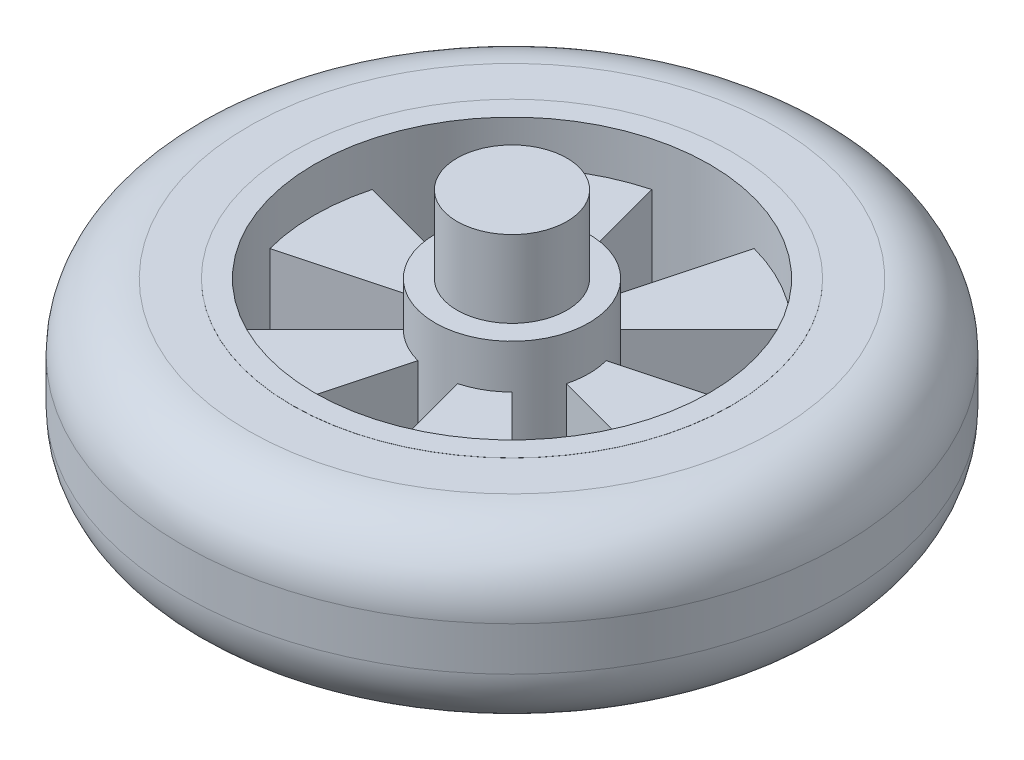
ISO-10303-21;
HEADER;
FILE_DESCRIPTION(('STEP AP214'),'2;1');
FILE_NAME('part.step','',(''),(''),'','','');
FILE_SCHEMA(('AUTOMOTIVE_DESIGN { 1 0 10303 214 1 1 1 1 }'));
ENDSEC;
DATA;
#1=APPLICATION_CONTEXT('core data for automotive mechanical design processes');
#2=APPLICATION_PROTOCOL_DEFINITION('international standard','automotive_design',2000,#1);
#3=PRODUCT_CONTEXT('',#1,'mechanical');
#4=PRODUCT('Part','Part','',(#3));
#5=PRODUCT_RELATED_PRODUCT_CATEGORY('part','',(#4));
#6=PRODUCT_DEFINITION_FORMATION('','',#4);
#7=PRODUCT_DEFINITION_CONTEXT('part definition',#1,'design');
#8=PRODUCT_DEFINITION('design','',#6,#7);
#9=PRODUCT_DEFINITION_SHAPE('','',#8);
#10=(LENGTH_UNIT() NAMED_UNIT(*) SI_UNIT(.MILLI.,.METRE.));
#11=(NAMED_UNIT(*) PLANE_ANGLE_UNIT() SI_UNIT($,.RADIAN.));
#12=(NAMED_UNIT(*) SI_UNIT($,.STERADIAN.) SOLID_ANGLE_UNIT());
#13=UNCERTAINTY_MEASURE_WITH_UNIT(LENGTH_MEASURE(1.E-05),#10,'distance_accuracy_value','');
#14=(GEOMETRIC_REPRESENTATION_CONTEXT(3) GLOBAL_UNCERTAINTY_ASSIGNED_CONTEXT((#13)) GLOBAL_UNIT_ASSIGNED_CONTEXT((#10,
#11,#12)) REPRESENTATION_CONTEXT('',''));
#15=CARTESIAN_POINT('',(0.,0.,0.));
#16=DIRECTION('',(0.,0.,1.));
#17=DIRECTION('',(1.,0.,0.));
#18=AXIS2_PLACEMENT_3D('',#15,#16,#17);
#19=CARTESIAN_POINT('',(0.,-8.,0.));
#20=DIRECTION('',(0.,1.,0.));
#21=DIRECTION('',(0.,0.,1.));
#22=AXIS2_PLACEMENT_3D('',#19,#20,#21);
#23=CYLINDRICAL_SURFACE('',#22,20.);
#24=CARTESIAN_POINT('',(0.,-8.,0.));
#25=DIRECTION('',(0.,1.,0.));
#26=DIRECTION('',(0.,0.,1.));
#27=AXIS2_PLACEMENT_3D('',#24,#25,#26);
#28=CIRCLE('',#27,20.);
#29=CARTESIAN_POINT('',(0.,-8.,20.));
#30=VERTEX_POINT('',#29);
#31=EDGE_CURVE('E238',#30,#30,#28,.T.);
#32=ORIENTED_EDGE('',*,*,#31,.T.);
#33=EDGE_LOOP('',(#32));
#34=FACE_BOUND('',#33,.T.);
#35=CARTESIAN_POINT('',(0.,-7.99,0.));
#36=DIRECTION('',(0.,1.,0.));
#37=DIRECTION('',(0.,0.,1.));
#38=AXIS2_PLACEMENT_3D('',#35,#36,#37);
#39=CIRCLE('',#38,20.);
#40=CARTESIAN_POINT('',(0.,-7.99,20.));
#41=VERTEX_POINT('',#40);
#42=EDGE_CURVE('E449',#41,#41,#39,.T.);
#43=ORIENTED_EDGE('',*,*,#42,.F.);
#44=EDGE_LOOP('',(#43));
#45=FACE_BOUND('',#44,.T.);
#46=ADVANCED_FACE('F35',(#34,#45),#23,.T.);
#47=CARTESIAN_POINT('',(0.,4.,0.));
#48=DIRECTION('',(0.,1.,0.));
#49=DIRECTION('',(0.,0.,1.));
#50=AXIS2_PLACEMENT_3D('',#47,#48,#49);
#51=PLANE('',#50);
#52=DIRECTION('',(-0.707106781186544,0.,-0.707106781186551));
#53=VECTOR('',#52,1.);
#54=CARTESIAN_POINT('',(-4.94974746830581,4.,-4.94974746830586));
#55=LINE('',#54,#53);
#56=CARTESIAN_POINT('',(-4.94974746830581,4.,-4.94974746830586));
#57=VERTEX_POINT('',#56);
#58=CARTESIAN_POINT('',(-12.7279220613578,4.,-12.7279220613579));
#59=VERTEX_POINT('',#58);
#60=EDGE_CURVE('E452',#57,#59,#55,.T.);
#61=ORIENTED_EDGE('',*,*,#60,.F.);
#62=CARTESIAN_POINT('',(0.,4.,0.));
#63=DIRECTION('',(0.,1.,0.));
#64=DIRECTION('',(0.,0.,1.));
#65=AXIS2_PLACEMENT_3D('',#62,#63,#64);
#66=CIRCLE('',#65,7.);
#67=CARTESIAN_POINT('',(-1.8117333157176,4.,-6.76148078402349));
#68=VERTEX_POINT('',#67);
#69=EDGE_CURVE('E235',#68,#57,#66,.T.);
#70=ORIENTED_EDGE('',*,*,#69,.F.);
#71=DIRECTION('',(0.258819045102515,0.,0.96592582628907));
#72=VECTOR('',#71,1.);
#73=CARTESIAN_POINT('',(-1.8117333157176,4.,-6.76148078402349));
#74=LINE('',#73,#72);
#75=CARTESIAN_POINT('',(-4.65874281184526,4.,-17.3866648732033));
#76=VERTEX_POINT('',#75);
#77=EDGE_CURVE('E529',#76,#68,#74,.T.);
#78=ORIENTED_EDGE('',*,*,#77,.F.);
#79=CARTESIAN_POINT('',(0.,4.,0.));
#80=DIRECTION('',(0.,1.,0.));
#81=DIRECTION('',(0.,0.,1.));
#82=AXIS2_PLACEMENT_3D('',#79,#80,#81);
#83=CIRCLE('',#82,18.);
#84=EDGE_CURVE('E225',#76,#59,#83,.T.);
#85=ORIENTED_EDGE('',*,*,#84,.T.);
#86=EDGE_LOOP('',(#61,#70,#78,#85));
#87=FACE_BOUND('',#86,.T.);
#88=ADVANCED_FACE('F308',(#87),#51,.T.);
#89=DIRECTION('',(0.965925826289064,0.,0.258819045102538));
#90=VECTOR('',#89,1.);
#91=CARTESIAN_POINT('',(-6.76148078402344,4.,-1.81173331571777));
#92=LINE('',#91,#90);
#93=CARTESIAN_POINT('',(-17.3866648732031,4.,-4.65874281184569));
#94=VERTEX_POINT('',#93);
#95=CARTESIAN_POINT('',(-6.76148078402344,4.,-1.81173331571777));
#96=VERTEX_POINT('',#95);
#97=EDGE_CURVE('E450',#94,#96,#92,.T.);
#98=ORIENTED_EDGE('',*,*,#97,.F.);
#99=CARTESIAN_POINT('',(-17.3866648732032,4.,4.65874281184533));
#100=VERTEX_POINT('',#99);
#101=EDGE_CURVE('E230',#94,#100,#83,.T.);
#102=ORIENTED_EDGE('',*,*,#101,.T.);
#103=DIRECTION('',(-0.965925826289069,0.,0.258819045102518));
#104=VECTOR('',#103,1.);
#105=CARTESIAN_POINT('',(-6.76148078402348,4.,1.81173331571763));
#106=LINE('',#105,#104);
#107=CARTESIAN_POINT('',(-6.76148078402348,4.,1.81173331571763));
#108=VERTEX_POINT('',#107);
#109=EDGE_CURVE('E478',#108,#100,#106,.T.);
#110=ORIENTED_EDGE('',*,*,#109,.F.);
#111=EDGE_CURVE('E367',#96,#108,#66,.T.);
#112=ORIENTED_EDGE('',*,*,#111,.F.);
#113=EDGE_LOOP('',(#98,#102,#110,#112));
#114=FACE_BOUND('',#113,.T.);
#115=ADVANCED_FACE('F313',(#114),#51,.T.);
#116=DIRECTION('',(0.707106781186559,0.,-0.707106781186537));
#117=VECTOR('',#116,1.);
#118=CARTESIAN_POINT('',(-4.94974746830591,4.,4.94974746830576));
#119=LINE('',#118,#117);
#120=CARTESIAN_POINT('',(-12.7279220613581,4.,12.7279220613577));
#121=VERTEX_POINT('',#120);
#122=CARTESIAN_POINT('',(-4.94974746830591,4.,4.94974746830576));
#123=VERTEX_POINT('',#122);
#124=EDGE_CURVE('E476',#121,#123,#119,.T.);
#125=ORIENTED_EDGE('',*,*,#124,.F.);
#126=CARTESIAN_POINT('',(-4.65874281184526,4.,17.3866648732033));
#127=VERTEX_POINT('',#126);
#128=EDGE_CURVE('E223',#121,#127,#83,.T.);
#129=ORIENTED_EDGE('',*,*,#128,.T.);
#130=DIRECTION('',(-0.258819045102514,0.,0.96592582628907));
#131=VECTOR('',#130,1.);
#132=CARTESIAN_POINT('',(-1.8117333157176,4.,6.76148078402349));
#133=LINE('',#132,#131);
#134=CARTESIAN_POINT('',(-1.8117333157176,4.,6.76148078402349));
#135=VERTEX_POINT('',#134);
#136=EDGE_CURVE('E464',#135,#127,#133,.T.);
#137=ORIENTED_EDGE('',*,*,#136,.F.);
#138=EDGE_CURVE('E373',#123,#135,#66,.T.);
#139=ORIENTED_EDGE('',*,*,#138,.F.);
#140=EDGE_LOOP('',(#125,#129,#137,#139));
#141=FACE_BOUND('',#140,.T.);
#142=ADVANCED_FACE('F617',(#141),#51,.T.);
#143=DIRECTION('',(-0.258819045102515,0.,-0.96592582628907));
#144=VECTOR('',#143,1.);
#145=CARTESIAN_POINT('',(1.8117333157176,4.,6.76148078402349));
#146=LINE('',#145,#144);
#147=CARTESIAN_POINT('',(4.65874281184526,4.,17.3866648732033));
#148=VERTEX_POINT('',#147);
#149=CARTESIAN_POINT('',(1.8117333157176,4.,6.76148078402349));
#150=VERTEX_POINT('',#149);
#151=EDGE_CURVE('E462',#148,#150,#146,.T.);
#152=ORIENTED_EDGE('',*,*,#151,.F.);
#153=CARTESIAN_POINT('',(12.7279220613579,4.,12.7279220613578));
#154=VERTEX_POINT('',#153);
#155=EDGE_CURVE('E219',#148,#154,#83,.T.);
#156=ORIENTED_EDGE('',*,*,#155,.T.);
#157=DIRECTION('',(0.707106781186549,0.,0.707106781186546));
#158=VECTOR('',#157,1.);
#159=CARTESIAN_POINT('',(4.94974746830584,4.,4.94974746830582));
#160=LINE('',#159,#158);
#161=CARTESIAN_POINT('',(4.94974746830584,4.,4.94974746830582));
#162=VERTEX_POINT('',#161);
#163=EDGE_CURVE('E203',#162,#154,#160,.T.);
#164=ORIENTED_EDGE('',*,*,#163,.F.);
#165=EDGE_CURVE('E378',#150,#162,#66,.T.);
#166=ORIENTED_EDGE('',*,*,#165,.F.);
#167=EDGE_LOOP('',(#152,#156,#164,#166));
#168=FACE_BOUND('',#167,.T.);
#169=ADVANCED_FACE('F628',(#168),#51,.T.);
#170=DIRECTION('',(-0.965925826289066,0.,-0.258819045102531));
#171=VECTOR('',#170,1.);
#172=CARTESIAN_POINT('',(6.76148078402346,4.,1.81173331571772));
#173=LINE('',#172,#171);
#174=CARTESIAN_POINT('',(17.3866648732032,4.,4.65874281184556));
#175=VERTEX_POINT('',#174);
#176=CARTESIAN_POINT('',(6.76148078402346,4.,1.81173331571772));
#177=VERTEX_POINT('',#176);
#178=EDGE_CURVE('E58',#175,#177,#173,.T.);
#179=ORIENTED_EDGE('',*,*,#178,.F.);
#180=CARTESIAN_POINT('',(17.3866648732032,4.,-4.65874281184545));
#181=VERTEX_POINT('',#180);
#182=EDGE_CURVE('E210',#175,#181,#83,.T.);
#183=ORIENTED_EDGE('',*,*,#182,.T.);
#184=DIRECTION('',(0.965925826289067,0.,-0.258819045102525));
#185=VECTOR('',#184,1.);
#186=CARTESIAN_POINT('',(6.76148078402347,4.,-1.81173331571768));
#187=LINE('',#186,#185);
#188=CARTESIAN_POINT('',(6.76148078402347,4.,-1.81173331571768));
#189=VERTEX_POINT('',#188);
#190=EDGE_CURVE('E501',#189,#181,#187,.T.);
#191=ORIENTED_EDGE('',*,*,#190,.F.);
#192=EDGE_CURVE('E212',#177,#189,#66,.T.);
#193=ORIENTED_EDGE('',*,*,#192,.F.);
#194=EDGE_LOOP('',(#179,#183,#191,#193));
#195=FACE_BOUND('',#194,.T.);
#196=ADVANCED_FACE('F208',(#195),#51,.T.);
#197=CARTESIAN_POINT('',(0.,-4.,0.));
#198=DIRECTION('',(0.,-1.,0.));
#199=DIRECTION('',(0.,0.,1.));
#200=AXIS2_PLACEMENT_3D('',#197,#198,#199);
#201=PLANE('',#200);
#202=DIRECTION('',(0.707106781186544,0.,0.707106781186551));
#203=VECTOR('',#202,1.);
#204=CARTESIAN_POINT('',(0.,-4.,0.));
#205=LINE('',#204,#203);
#206=CARTESIAN_POINT('',(-12.7279220613578,-4.,-12.7279220613579));
#207=VERTEX_POINT('',#206);
#208=CARTESIAN_POINT('',(-4.94974746830581,-4.,-4.94974746830586));
#209=VERTEX_POINT('',#208);
#210=EDGE_CURVE('E527',#207,#209,#205,.T.);
#211=ORIENTED_EDGE('',*,*,#210,.F.);
#212=CARTESIAN_POINT('',(0.,-4.,0.));
#213=DIRECTION('',(0.,1.,0.));
#214=DIRECTION('',(0.,0.,1.));
#215=AXIS2_PLACEMENT_3D('',#212,#213,#214);
#216=CIRCLE('',#215,18.);
#217=CARTESIAN_POINT('',(-4.65874281184526,-4.,-17.3866648732033));
#218=VERTEX_POINT('',#217);
#219=EDGE_CURVE('E359',#218,#207,#216,.T.);
#220=ORIENTED_EDGE('',*,*,#219,.F.);
#221=DIRECTION('',(-0.258819045102515,0.,-0.96592582628907));
#222=VECTOR('',#221,1.);
#223=CARTESIAN_POINT('',(0.,-4.,0.));
#224=LINE('',#223,#222);
#225=CARTESIAN_POINT('',(-1.8117333157176,-4.,-6.76148078402349));
#226=VERTEX_POINT('',#225);
#227=EDGE_CURVE('E356',#226,#218,#224,.T.);
#228=ORIENTED_EDGE('',*,*,#227,.F.);
#229=CARTESIAN_POINT('',(0.,-4.,0.));
#230=DIRECTION('',(0.,1.,0.));
#231=DIRECTION('',(0.,0.,1.));
#232=AXIS2_PLACEMENT_3D('',#229,#230,#231);
#233=CIRCLE('',#232,7.);
#234=EDGE_CURVE('E354',#226,#209,#233,.T.);
#235=ORIENTED_EDGE('',*,*,#234,.T.);
#236=EDGE_LOOP('',(#211,#220,#228,#235));
#237=FACE_BOUND('',#236,.T.);
#238=ADVANCED_FACE('F394',(#237),#201,.T.);
#239=DIRECTION('',(-0.965925826289064,0.,-0.258819045102538));
#240=VECTOR('',#239,1.);
#241=CARTESIAN_POINT('',(0.,-4.,0.));
#242=LINE('',#241,#240);
#243=CARTESIAN_POINT('',(-6.76148078402344,-4.,-1.81173331571777));
#244=VERTEX_POINT('',#243);
#245=CARTESIAN_POINT('',(-17.3866648732031,-4.,-4.65874281184569));
#246=VERTEX_POINT('',#245);
#247=EDGE_CURVE('E525',#244,#246,#242,.T.);
#248=ORIENTED_EDGE('',*,*,#247,.F.);
#249=CARTESIAN_POINT('',(-6.76148078402348,-4.,1.81173331571763));
#250=VERTEX_POINT('',#249);
#251=EDGE_CURVE('E555',#244,#250,#233,.T.);
#252=ORIENTED_EDGE('',*,*,#251,.T.);
#253=DIRECTION('',(0.965925826289069,0.,-0.258819045102518));
#254=VECTOR('',#253,1.);
#255=CARTESIAN_POINT('',(0.,-4.,0.));
#256=LINE('',#255,#254);
#257=CARTESIAN_POINT('',(-17.3866648732032,-4.,4.65874281184533));
#258=VERTEX_POINT('',#257);
#259=EDGE_CURVE('E523',#258,#250,#256,.T.);
#260=ORIENTED_EDGE('',*,*,#259,.F.);
#261=EDGE_CURVE('E362',#246,#258,#216,.T.);
#262=ORIENTED_EDGE('',*,*,#261,.F.);
#263=EDGE_LOOP('',(#248,#252,#260,#262));
#264=FACE_BOUND('',#263,.T.);
#265=ADVANCED_FACE('F604',(#264),#201,.T.);
#266=DIRECTION('',(-0.707106781186559,0.,0.707106781186537));
#267=VECTOR('',#266,1.);
#268=CARTESIAN_POINT('',(0.,-4.,0.));
#269=LINE('',#268,#267);
#270=CARTESIAN_POINT('',(-4.94974746830591,-4.,4.94974746830576));
#271=VERTEX_POINT('',#270);
#272=CARTESIAN_POINT('',(-12.7279220613581,-4.,12.7279220613577));
#273=VERTEX_POINT('',#272);
#274=EDGE_CURVE('E521',#271,#273,#269,.T.);
#275=ORIENTED_EDGE('',*,*,#274,.F.);
#276=CARTESIAN_POINT('',(-1.8117333157176,-4.,6.76148078402349));
#277=VERTEX_POINT('',#276);
#278=EDGE_CURVE('E557',#271,#277,#233,.T.);
#279=ORIENTED_EDGE('',*,*,#278,.T.);
#280=DIRECTION('',(0.258819045102514,0.,-0.96592582628907));
#281=VECTOR('',#280,1.);
#282=CARTESIAN_POINT('',(0.,-4.,0.));
#283=LINE('',#282,#281);
#284=CARTESIAN_POINT('',(-4.65874281184526,-4.,17.3866648732033));
#285=VERTEX_POINT('',#284);
#286=EDGE_CURVE('E519',#285,#277,#283,.T.);
#287=ORIENTED_EDGE('',*,*,#286,.F.);
#288=EDGE_CURVE('E582',#273,#285,#216,.T.);
#289=ORIENTED_EDGE('',*,*,#288,.F.);
#290=EDGE_LOOP('',(#275,#279,#287,#289));
#291=FACE_BOUND('',#290,.T.);
#292=ADVANCED_FACE('F632',(#291),#201,.T.);
#293=DIRECTION('',(0.258819045102515,0.,0.96592582628907));
#294=VECTOR('',#293,1.);
#295=CARTESIAN_POINT('',(0.,-4.,0.));
#296=LINE('',#295,#294);
#297=CARTESIAN_POINT('',(1.8117333157176,-4.,6.76148078402349));
#298=VERTEX_POINT('',#297);
#299=CARTESIAN_POINT('',(4.65874281184526,-4.,17.3866648732033));
#300=VERTEX_POINT('',#299);
#301=EDGE_CURVE('E517',#298,#300,#296,.T.);
#302=ORIENTED_EDGE('',*,*,#301,.F.);
#303=CARTESIAN_POINT('',(4.94974746830584,-4.,4.94974746830582));
#304=VERTEX_POINT('',#303);
#305=EDGE_CURVE('E563',#298,#304,#233,.T.);
#306=ORIENTED_EDGE('',*,*,#305,.T.);
#307=DIRECTION('',(-0.707106781186549,0.,-0.707106781186546));
#308=VECTOR('',#307,1.);
#309=CARTESIAN_POINT('',(0.,-4.,0.));
#310=LINE('',#309,#308);
#311=CARTESIAN_POINT('',(12.7279220613579,-4.,12.7279220613578));
#312=VERTEX_POINT('',#311);
#313=EDGE_CURVE('E515',#312,#304,#310,.T.);
#314=ORIENTED_EDGE('',*,*,#313,.F.);
#315=EDGE_CURVE('E580',#300,#312,#216,.T.);
#316=ORIENTED_EDGE('',*,*,#315,.F.);
#317=EDGE_LOOP('',(#302,#306,#314,#316));
#318=FACE_BOUND('',#317,.T.);
#319=ADVANCED_FACE('F630',(#318),#201,.T.);
#320=DIRECTION('',(0.965925826289066,0.,0.258819045102531));
#321=VECTOR('',#320,1.);
#322=CARTESIAN_POINT('',(0.,-4.,0.));
#323=LINE('',#322,#321);
#324=CARTESIAN_POINT('',(6.76148078402346,-4.,1.81173331571772));
#325=VERTEX_POINT('',#324);
#326=CARTESIAN_POINT('',(17.3866648732032,-4.,4.65874281184556));
#327=VERTEX_POINT('',#326);
#328=EDGE_CURVE('E197',#325,#327,#323,.T.);
#329=ORIENTED_EDGE('',*,*,#328,.F.);
#330=CARTESIAN_POINT('',(6.76148078402347,-4.,-1.81173331571768));
#331=VERTEX_POINT('',#330);
#332=EDGE_CURVE('E352',#325,#331,#233,.T.);
#333=ORIENTED_EDGE('',*,*,#332,.T.);
#334=DIRECTION('',(-0.965925826289067,0.,0.258819045102525));
#335=VECTOR('',#334,1.);
#336=CARTESIAN_POINT('',(0.,-4.,0.));
#337=LINE('',#336,#335);
#338=CARTESIAN_POINT('',(17.3866648732032,-4.,-4.65874281184545));
#339=VERTEX_POINT('',#338);
#340=EDGE_CURVE('E512',#339,#331,#337,.T.);
#341=ORIENTED_EDGE('',*,*,#340,.F.);
#342=EDGE_CURVE('E579',#327,#339,#216,.T.);
#343=ORIENTED_EDGE('',*,*,#342,.F.);
#344=EDGE_LOOP('',(#329,#333,#341,#343));
#345=FACE_BOUND('',#344,.T.);
#346=ADVANCED_FACE('F283',(#345),#201,.T.);
#347=CARTESIAN_POINT('',(0.,7.99,0.));
#348=DIRECTION('',(0.,1.,0.));
#349=DIRECTION('',(0.,0.,1.));
#350=AXIS2_PLACEMENT_3D('',#347,#348,#349);
#351=CIRCLE('',#350,20.);
#352=CARTESIAN_POINT('',(0.,7.99,20.));
#353=VERTEX_POINT('',#352);
#354=EDGE_CURVE('E251',#353,#353,#351,.F.);
#355=ORIENTED_EDGE('',*,*,#354,.F.);
#356=EDGE_LOOP('',(#355));
#357=FACE_BOUND('',#356,.T.);
#358=CARTESIAN_POINT('',(0.,8.,0.));
#359=DIRECTION('',(0.,1.,0.));
#360=DIRECTION('',(0.,0.,1.));
#361=AXIS2_PLACEMENT_3D('',#358,#359,#360);
#362=CIRCLE('',#361,20.);
#363=CARTESIAN_POINT('',(0.,8.,20.));
#364=VERTEX_POINT('',#363);
#365=EDGE_CURVE('E229',#364,#364,#362,.T.);
#366=ORIENTED_EDGE('',*,*,#365,.F.);
#367=EDGE_LOOP('',(#366));
#368=FACE_BOUND('',#367,.T.);
#369=ADVANCED_FACE('F279',(#357,#368),#23,.T.);
#370=CARTESIAN_POINT('',(0.,-8.,0.));
#371=DIRECTION('',(0.,1.,0.));
#372=DIRECTION('',(0.,0.,1.));
#373=AXIS2_PLACEMENT_3D('',#370,#371,#372);
#374=PLANE('',#373);
#375=CARTESIAN_POINT('',(0.,-8.,0.));
#376=DIRECTION('',(0.,1.,0.));
#377=DIRECTION('',(0.,0.,1.));
#378=AXIS2_PLACEMENT_3D('',#375,#376,#377);
#379=CIRCLE('',#378,18.);
#380=CARTESIAN_POINT('',(0.,-8.,18.));
#381=VERTEX_POINT('',#380);
#382=EDGE_CURVE('E364',#381,#381,#379,.T.);
#383=ORIENTED_EDGE('',*,*,#382,.T.);
#384=EDGE_LOOP('',(#383));
#385=FACE_BOUND('',#384,.T.);
#386=ORIENTED_EDGE('',*,*,#31,.F.);
#387=EDGE_LOOP('',(#386));
#388=FACE_BOUND('',#387,.T.);
#389=ADVANCED_FACE('F282',(#385,#388),#374,.F.);
#390=CARTESIAN_POINT('',(0.,8.,0.));
#391=DIRECTION('',(0.,1.,0.));
#392=DIRECTION('',(0.,0.,1.));
#393=AXIS2_PLACEMENT_3D('',#390,#391,#392);
#394=PLANE('',#393);
#395=CARTESIAN_POINT('',(0.,8.,0.));
#396=DIRECTION('',(0.,1.,0.));
#397=DIRECTION('',(0.,0.,1.));
#398=AXIS2_PLACEMENT_3D('',#395,#396,#397);
#399=CIRCLE('',#398,18.);
#400=CARTESIAN_POINT('',(0.,8.,18.));
#401=VERTEX_POINT('',#400);
#402=EDGE_CURVE('E224',#401,#401,#399,.T.);
#403=ORIENTED_EDGE('',*,*,#402,.F.);
#404=EDGE_LOOP('',(#403));
#405=FACE_BOUND('',#404,.T.);
#406=ORIENTED_EDGE('',*,*,#365,.T.);
#407=EDGE_LOOP('',(#406));
#408=FACE_BOUND('',#407,.T.);
#409=ADVANCED_FACE('F287',(#405,#408),#394,.T.);
#410=CARTESIAN_POINT('',(0.,4.,0.));
#411=DIRECTION('',(0.,1.,0.));
#412=DIRECTION('',(0.,0.,1.));
#413=AXIS2_PLACEMENT_3D('',#410,#411,#412);
#414=CYLINDRICAL_SURFACE('',#413,18.);
#415=ORIENTED_EDGE('',*,*,#382,.F.);
#416=EDGE_LOOP('',(#415));
#417=FACE_BOUND('',#416,.T.);
#418=DIRECTION('',(0.,1.,0.));
#419=VECTOR('',#418,1.);
#420=CARTESIAN_POINT('',(-17.3866648732031,-10.,-4.65874281184569));
#421=LINE('',#420,#419);
#422=EDGE_CURVE('E492',#246,#94,#421,.T.);
#423=ORIENTED_EDGE('',*,*,#422,.F.);
#424=ORIENTED_EDGE('',*,*,#261,.T.);
#425=DIRECTION('',(0.,1.,0.));
#426=VECTOR('',#425,1.);
#427=CARTESIAN_POINT('',(-17.3866648732032,-10.,4.65874281184533));
#428=LINE('',#427,#426);
#429=EDGE_CURVE('E465',#258,#100,#428,.T.);
#430=ORIENTED_EDGE('',*,*,#429,.T.);
#431=ORIENTED_EDGE('',*,*,#101,.F.);
#432=EDGE_LOOP('',(#423,#424,#430,#431));
#433=FACE_BOUND('',#432,.T.);
#434=DIRECTION('',(0.,1.,0.));
#435=VECTOR('',#434,1.);
#436=CARTESIAN_POINT('',(-12.7279220613581,-10.,12.7279220613577));
#437=LINE('',#436,#435);
#438=EDGE_CURVE('E482',#273,#121,#437,.T.);
#439=ORIENTED_EDGE('',*,*,#438,.F.);
#440=ORIENTED_EDGE('',*,*,#288,.T.);
#441=DIRECTION('',(0.,1.,0.));
#442=VECTOR('',#441,1.);
#443=CARTESIAN_POINT('',(-4.65874281184526,-10.,17.3866648732033));
#444=LINE('',#443,#442);
#445=EDGE_CURVE('E213',#285,#127,#444,.T.);
#446=ORIENTED_EDGE('',*,*,#445,.T.);
#447=ORIENTED_EDGE('',*,*,#128,.F.);
#448=EDGE_LOOP('',(#439,#440,#446,#447));
#449=FACE_BOUND('',#448,.T.);
#450=DIRECTION('',(0.,1.,0.));
#451=VECTOR('',#450,1.);
#452=CARTESIAN_POINT('',(4.65874281184526,-10.,17.3866648732033));
#453=LINE('',#452,#451);
#454=EDGE_CURVE('E468',#300,#148,#453,.T.);
#455=ORIENTED_EDGE('',*,*,#454,.F.);
#456=ORIENTED_EDGE('',*,*,#315,.T.);
#457=DIRECTION('',(0.,1.,0.));
#458=VECTOR('',#457,1.);
#459=CARTESIAN_POINT('',(12.7279220613579,-10.,12.7279220613578));
#460=LINE('',#459,#458);
#461=EDGE_CURVE('E457',#312,#154,#460,.T.);
#462=ORIENTED_EDGE('',*,*,#461,.T.);
#463=ORIENTED_EDGE('',*,*,#155,.F.);
#464=EDGE_LOOP('',(#455,#456,#462,#463));
#465=FACE_BOUND('',#464,.T.);
#466=DIRECTION('',(0.,1.,0.));
#467=VECTOR('',#466,1.);
#468=CARTESIAN_POINT('',(17.3866648732032,-10.,4.65874281184556));
#469=LINE('',#468,#467);
#470=EDGE_CURVE('E194',#327,#175,#469,.T.);
#471=ORIENTED_EDGE('',*,*,#470,.F.);
#472=ORIENTED_EDGE('',*,*,#342,.T.);
#473=DIRECTION('',(0.,1.,0.));
#474=VECTOR('',#473,1.);
#475=CARTESIAN_POINT('',(17.3866648732032,-10.,-4.65874281184545));
#476=LINE('',#475,#474);
#477=EDGE_CURVE('E217',#339,#181,#476,.T.);
#478=ORIENTED_EDGE('',*,*,#477,.T.);
#479=ORIENTED_EDGE('',*,*,#182,.F.);
#480=EDGE_LOOP('',(#471,#472,#478,#479));
#481=FACE_BOUND('',#480,.T.);
#482=ORIENTED_EDGE('',*,*,#219,.T.);
#483=DIRECTION('',(0.,1.,0.));
#484=VECTOR('',#483,1.);
#485=CARTESIAN_POINT('',(-12.7279220613578,-10.,-12.7279220613579));
#486=LINE('',#485,#484);
#487=EDGE_CURVE('E479',#207,#59,#486,.T.);
#488=ORIENTED_EDGE('',*,*,#487,.T.);
#489=ORIENTED_EDGE('',*,*,#84,.F.);
#490=DIRECTION('',(0.,1.,0.));
#491=VECTOR('',#490,1.);
#492=CARTESIAN_POINT('',(-4.65874281184526,-10.,-17.3866648732033));
#493=LINE('',#492,#491);
#494=EDGE_CURVE('E535',#218,#76,#493,.T.);
#495=ORIENTED_EDGE('',*,*,#494,.F.);
#496=EDGE_LOOP('',(#482,#488,#489,#495));
#497=FACE_BOUND('',#496,.T.);
#498=DIRECTION('',(0.,1.,0.));
#499=VECTOR('',#498,1.);
#500=CARTESIAN_POINT('',(12.727922061358,-10.,-12.7279220613577));
#501=LINE('',#500,#499);
#502=CARTESIAN_POINT('',(12.727922061358,-4.,-12.7279220613577));
#503=VERTEX_POINT('',#502);
#504=CARTESIAN_POINT('',(12.727922061358,4.,-12.7279220613577));
#505=VERTEX_POINT('',#504);
#506=EDGE_CURVE('E503',#503,#505,#501,.T.);
#507=ORIENTED_EDGE('',*,*,#506,.F.);
#508=CARTESIAN_POINT('',(4.65874281184526,-4.,-17.3866648732033));
#509=VERTEX_POINT('',#508);
#510=EDGE_CURVE('E363',#503,#509,#216,.T.);
#511=ORIENTED_EDGE('',*,*,#510,.T.);
#512=DIRECTION('',(0.,1.,0.));
#513=VECTOR('',#512,1.);
#514=CARTESIAN_POINT('',(4.65874281184526,-10.,-17.3866648732033));
#515=LINE('',#514,#513);
#516=CARTESIAN_POINT('',(4.65874281184526,4.,-17.3866648732033));
#517=VERTEX_POINT('',#516);
#518=EDGE_CURVE('E536',#509,#517,#515,.T.);
#519=ORIENTED_EDGE('',*,*,#518,.T.);
#520=EDGE_CURVE('E220',#505,#517,#83,.T.);
#521=ORIENTED_EDGE('',*,*,#520,.F.);
#522=EDGE_LOOP('',(#507,#511,#519,#521));
#523=FACE_BOUND('',#522,.T.);
#524=ORIENTED_EDGE('',*,*,#402,.T.);
#525=EDGE_LOOP('',(#524));
#526=FACE_BOUND('',#525,.T.);
#527=ADVANCED_FACE('F215',(#417,#433,#449,#465,#481,#497,#523,#526),#414,.F.);
#528=DIRECTION('',(-0.707106781186554,0.,0.707106781186541));
#529=VECTOR('',#528,1.);
#530=CARTESIAN_POINT('',(4.94974746830588,4.,-4.94974746830579));
#531=LINE('',#530,#529);
#532=CARTESIAN_POINT('',(4.94974746830588,4.,-4.94974746830579));
#533=VERTEX_POINT('',#532);
#534=EDGE_CURVE('E50',#505,#533,#531,.T.);
#535=ORIENTED_EDGE('',*,*,#534,.F.);
#536=ORIENTED_EDGE('',*,*,#520,.T.);
#537=DIRECTION('',(0.258819045102514,0.,-0.96592582628907));
#538=VECTOR('',#537,1.);
#539=CARTESIAN_POINT('',(1.8117333157176,4.,-6.76148078402349));
#540=LINE('',#539,#538);
#541=CARTESIAN_POINT('',(1.8117333157176,4.,-6.76148078402349));
#542=VERTEX_POINT('',#541);
#543=EDGE_CURVE('E532',#542,#517,#540,.T.);
#544=ORIENTED_EDGE('',*,*,#543,.F.);
#545=EDGE_CURVE('E368',#533,#542,#66,.T.);
#546=ORIENTED_EDGE('',*,*,#545,.F.);
#547=EDGE_LOOP('',(#535,#536,#544,#546));
#548=FACE_BOUND('',#547,.T.);
#549=ADVANCED_FACE('F296',(#548),#51,.T.);
#550=CARTESIAN_POINT('',(0.,4.,0.));
#551=DIRECTION('',(0.,1.,0.));
#552=DIRECTION('',(0.,0.,1.));
#553=AXIS2_PLACEMENT_3D('',#550,#551,#552);
#554=CYLINDRICAL_SURFACE('',#553,7.);
#555=CARTESIAN_POINT('',(0.,-8.,0.));
#556=DIRECTION('',(0.,1.,0.));
#557=DIRECTION('',(0.,0.,1.));
#558=AXIS2_PLACEMENT_3D('',#555,#556,#557);
#559=CIRCLE('',#558,7.);
#560=CARTESIAN_POINT('',(0.,-8.,7.));
#561=VERTEX_POINT('',#560);
#562=EDGE_CURVE('E347',#561,#561,#559,.T.);
#563=ORIENTED_EDGE('',*,*,#562,.T.);
#564=EDGE_LOOP('',(#563));
#565=FACE_BOUND('',#564,.T.);
#566=ORIENTED_EDGE('',*,*,#251,.F.);
#567=DIRECTION('',(0.,1.,0.));
#568=VECTOR('',#567,1.);
#569=CARTESIAN_POINT('',(-6.76148078402344,-10.,-1.81173331571777));
#570=LINE('',#569,#568);
#571=EDGE_CURVE('E496',#244,#96,#570,.T.);
#572=ORIENTED_EDGE('',*,*,#571,.T.);
#573=ORIENTED_EDGE('',*,*,#111,.T.);
#574=DIRECTION('',(0.,1.,0.));
#575=VECTOR('',#574,1.);
#576=CARTESIAN_POINT('',(-6.76148078402348,-10.,1.81173331571763));
#577=LINE('',#576,#575);
#578=EDGE_CURVE('E484',#250,#108,#577,.T.);
#579=ORIENTED_EDGE('',*,*,#578,.F.);
#580=EDGE_LOOP('',(#566,#572,#573,#579));
#581=FACE_BOUND('',#580,.T.);
#582=ORIENTED_EDGE('',*,*,#278,.F.);
#583=DIRECTION('',(0.,1.,0.));
#584=VECTOR('',#583,1.);
#585=CARTESIAN_POINT('',(-4.94974746830591,-10.,4.94974746830575));
#586=LINE('',#585,#584);
#587=EDGE_CURVE('E486',#271,#123,#586,.T.);
#588=ORIENTED_EDGE('',*,*,#587,.T.);
#589=ORIENTED_EDGE('',*,*,#138,.T.);
#590=DIRECTION('',(0.,1.,0.));
#591=VECTOR('',#590,1.);
#592=CARTESIAN_POINT('',(-1.8117333157176,-10.,6.76148078402349));
#593=LINE('',#592,#591);
#594=EDGE_CURVE('E470',#277,#135,#593,.T.);
#595=ORIENTED_EDGE('',*,*,#594,.F.);
#596=EDGE_LOOP('',(#582,#588,#589,#595));
#597=FACE_BOUND('',#596,.T.);
#598=ORIENTED_EDGE('',*,*,#305,.F.);
#599=DIRECTION('',(0.,1.,0.));
#600=VECTOR('',#599,1.);
#601=CARTESIAN_POINT('',(1.8117333157176,-10.,6.76148078402349));
#602=LINE('',#601,#600);
#603=EDGE_CURVE('E472',#298,#150,#602,.T.);
#604=ORIENTED_EDGE('',*,*,#603,.T.);
#605=ORIENTED_EDGE('',*,*,#165,.T.);
#606=DIRECTION('',(0.,1.,0.));
#607=VECTOR('',#606,1.);
#608=CARTESIAN_POINT('',(4.94974746830584,-10.,4.94974746830582));
#609=LINE('',#608,#607);
#610=EDGE_CURVE('E459',#304,#162,#609,.T.);
#611=ORIENTED_EDGE('',*,*,#610,.F.);
#612=EDGE_LOOP('',(#598,#604,#605,#611));
#613=FACE_BOUND('',#612,.T.);
#614=ORIENTED_EDGE('',*,*,#332,.F.);
#615=DIRECTION('',(0.,1.,0.));
#616=VECTOR('',#615,1.);
#617=CARTESIAN_POINT('',(6.76148078402346,-10.,1.81173331571772));
#618=LINE('',#617,#616);
#619=EDGE_CURVE('E202',#325,#177,#618,.T.);
#620=ORIENTED_EDGE('',*,*,#619,.T.);
#621=ORIENTED_EDGE('',*,*,#192,.T.);
#622=DIRECTION('',(0.,1.,0.));
#623=VECTOR('',#622,1.);
#624=CARTESIAN_POINT('',(6.76148078402347,-10.,-1.81173331571768));
#625=LINE('',#624,#623);
#626=EDGE_CURVE('E506',#331,#189,#625,.T.);
#627=ORIENTED_EDGE('',*,*,#626,.F.);
#628=EDGE_LOOP('',(#614,#620,#621,#627));
#629=FACE_BOUND('',#628,.T.);
#630=DIRECTION('',(0.,1.,0.));
#631=VECTOR('',#630,1.);
#632=CARTESIAN_POINT('',(-4.94974746830581,-10.,-4.94974746830586));
#633=LINE('',#632,#631);
#634=EDGE_CURVE('E494',#209,#57,#633,.T.);
#635=ORIENTED_EDGE('',*,*,#634,.F.);
#636=ORIENTED_EDGE('',*,*,#234,.F.);
#637=DIRECTION('',(0.,1.,0.));
#638=VECTOR('',#637,1.);
#639=CARTESIAN_POINT('',(-1.8117333157176,-10.,-6.76148078402349));
#640=LINE('',#639,#638);
#641=EDGE_CURVE('E541',#226,#68,#640,.T.);
#642=ORIENTED_EDGE('',*,*,#641,.T.);
#643=ORIENTED_EDGE('',*,*,#69,.T.);
#644=EDGE_LOOP('',(#635,#636,#642,#643));
#645=FACE_BOUND('',#644,.T.);
#646=CARTESIAN_POINT('',(4.94974746830588,-4.,-4.94974746830579));
#647=VERTEX_POINT('',#646);
#648=CARTESIAN_POINT('',(1.8117333157176,-4.,-6.76148078402349));
#649=VERTEX_POINT('',#648);
#650=EDGE_CURVE('E349',#647,#649,#233,.T.);
#651=ORIENTED_EDGE('',*,*,#650,.F.);
#652=DIRECTION('',(0.,1.,0.));
#653=VECTOR('',#652,1.);
#654=CARTESIAN_POINT('',(4.94974746830588,-10.,-4.94974746830579));
#655=LINE('',#654,#653);
#656=EDGE_CURVE('E508',#647,#533,#655,.T.);
#657=ORIENTED_EDGE('',*,*,#656,.T.);
#658=ORIENTED_EDGE('',*,*,#545,.T.);
#659=DIRECTION('',(0.,1.,0.));
#660=VECTOR('',#659,1.);
#661=CARTESIAN_POINT('',(1.8117333157176,-10.,-6.76148078402349));
#662=LINE('',#661,#660);
#663=EDGE_CURVE('E539',#649,#542,#662,.T.);
#664=ORIENTED_EDGE('',*,*,#663,.F.);
#665=EDGE_LOOP('',(#651,#657,#658,#664));
#666=FACE_BOUND('',#665,.T.);
#667=CARTESIAN_POINT('',(0.,8.,0.));
#668=DIRECTION('',(0.,1.,0.));
#669=DIRECTION('',(0.,0.,1.));
#670=AXIS2_PLACEMENT_3D('',#667,#668,#669);
#671=CIRCLE('',#670,7.);
#672=CARTESIAN_POINT('',(0.,8.,7.));
#673=VERTEX_POINT('',#672);
#674=EDGE_CURVE('E231',#673,#673,#671,.T.);
#675=ORIENTED_EDGE('',*,*,#674,.F.);
#676=EDGE_LOOP('',(#675));
#677=FACE_BOUND('',#676,.T.);
#678=ADVANCED_FACE('F321',(#565,#581,#597,#613,#629,#645,#666,#677),#554,.T.);
#679=CARTESIAN_POINT('',(0.,15.,0.));
#680=DIRECTION('',(0.,1.,0.));
#681=DIRECTION('',(0.,0.,1.));
#682=AXIS2_PLACEMENT_3D('',#679,#680,#681);
#683=PLANE('',#682);
#684=CARTESIAN_POINT('',(0.,15.,0.));
#685=DIRECTION('',(0.,1.,0.));
#686=DIRECTION('',(0.,0.,1.));
#687=AXIS2_PLACEMENT_3D('',#684,#685,#686);
#688=CIRCLE('',#687,5.);
#689=CARTESIAN_POINT('',(0.,15.,5.));
#690=VERTEX_POINT('',#689);
#691=EDGE_CURVE('E242',#690,#690,#688,.T.);
#692=ORIENTED_EDGE('',*,*,#691,.T.);
#693=EDGE_LOOP('',(#692));
#694=FACE_BOUND('',#693,.T.);
#695=ADVANCED_FACE('F318',(#694),#683,.T.);
#696=CARTESIAN_POINT('',(0.,-15.,0.));
#697=DIRECTION('',(0.,1.,0.));
#698=DIRECTION('',(0.,0.,1.));
#699=AXIS2_PLACEMENT_3D('',#696,#697,#698);
#700=CYLINDRICAL_SURFACE('',#699,5.);
#701=CARTESIAN_POINT('',(0.,8.,0.));
#702=DIRECTION('',(0.,1.,0.));
#703=DIRECTION('',(0.,0.,1.));
#704=AXIS2_PLACEMENT_3D('',#701,#702,#703);
#705=CIRCLE('',#704,5.);
#706=CARTESIAN_POINT('',(0.,8.,5.));
#707=VERTEX_POINT('',#706);
#708=EDGE_CURVE('E248',#707,#707,#705,.F.);
#709=ORIENTED_EDGE('',*,*,#708,.F.);
#710=EDGE_LOOP('',(#709));
#711=FACE_BOUND('',#710,.T.);
#712=ORIENTED_EDGE('',*,*,#691,.F.);
#713=EDGE_LOOP('',(#712));
#714=FACE_BOUND('',#713,.T.);
#715=ADVANCED_FACE('F305',(#711,#714),#700,.T.);
#716=ORIENTED_EDGE('',*,*,#708,.T.);
#717=EDGE_LOOP('',(#716));
#718=FACE_BOUND('',#717,.T.);
#719=ORIENTED_EDGE('',*,*,#674,.T.);
#720=EDGE_LOOP('',(#719));
#721=FACE_BOUND('',#720,.T.);
#722=ADVANCED_FACE('F291',(#718,#721),#394,.T.);
#723=DIRECTION('',(0.707106781186554,0.,-0.707106781186541));
#724=VECTOR('',#723,1.);
#725=CARTESIAN_POINT('',(0.,-4.,0.));
#726=LINE('',#725,#724);
#727=EDGE_CURVE('E505',#647,#503,#726,.T.);
#728=ORIENTED_EDGE('',*,*,#727,.F.);
#729=ORIENTED_EDGE('',*,*,#650,.T.);
#730=DIRECTION('',(-0.258819045102514,0.,0.96592582628907));
#731=VECTOR('',#730,1.);
#732=CARTESIAN_POINT('',(0.,-4.,0.));
#733=LINE('',#732,#731);
#734=EDGE_CURVE('E350',#509,#649,#733,.T.);
#735=ORIENTED_EDGE('',*,*,#734,.F.);
#736=ORIENTED_EDGE('',*,*,#510,.F.);
#737=EDGE_LOOP('',(#728,#729,#735,#736));
#738=FACE_BOUND('',#737,.T.);
#739=ADVANCED_FACE('F304',(#738),#201,.T.);
#740=CARTESIAN_POINT('',(0.,-15.,0.));
#741=DIRECTION('',(0.,1.,0.));
#742=DIRECTION('',(0.,0.,1.));
#743=AXIS2_PLACEMENT_3D('',#740,#741,#742);
#744=PLANE('',#743);
#745=CARTESIAN_POINT('',(0.,-15.,0.));
#746=DIRECTION('',(0.,1.,0.));
#747=DIRECTION('',(0.,0.,1.));
#748=AXIS2_PLACEMENT_3D('',#745,#746,#747);
#749=CIRCLE('',#748,5.);
#750=CARTESIAN_POINT('',(0.,-15.,5.));
#751=VERTEX_POINT('',#750);
#752=EDGE_CURVE('E245',#751,#751,#749,.T.);
#753=ORIENTED_EDGE('',*,*,#752,.F.);
#754=EDGE_LOOP('',(#753));
#755=FACE_BOUND('',#754,.T.);
#756=ADVANCED_FACE('F323',(#755),#744,.F.);
#757=ORIENTED_EDGE('',*,*,#752,.T.);
#758=EDGE_LOOP('',(#757));
#759=FACE_BOUND('',#758,.T.);
#760=CARTESIAN_POINT('',(0.,-8.,0.));
#761=DIRECTION('',(0.,1.,0.));
#762=DIRECTION('',(0.,0.,1.));
#763=AXIS2_PLACEMENT_3D('',#760,#761,#762);
#764=CIRCLE('',#763,5.);
#765=CARTESIAN_POINT('',(0.,-8.,5.));
#766=VERTEX_POINT('',#765);
#767=EDGE_CURVE('E241',#766,#766,#764,.F.);
#768=ORIENTED_EDGE('',*,*,#767,.T.);
#769=EDGE_LOOP('',(#768));
#770=FACE_BOUND('',#769,.T.);
#771=ADVANCED_FACE('F326',(#759,#770),#700,.T.);
#772=ORIENTED_EDGE('',*,*,#767,.F.);
#773=EDGE_LOOP('',(#772));
#774=FACE_BOUND('',#773,.T.);
#775=ORIENTED_EDGE('',*,*,#562,.F.);
#776=EDGE_LOOP('',(#775));
#777=FACE_BOUND('',#776,.T.);
#778=ADVANCED_FACE('F301',(#774,#777),#374,.F.);
#779=CARTESIAN_POINT('',(1.8117333157176,-10.,-6.76148078402349));
#780=DIRECTION('',(0.96592582628907,0.,0.258819045102514));
#781=DIRECTION('',(0.258819045102514,0.,-0.96592582628907));
#782=AXIS2_PLACEMENT_3D('',#779,#780,#781);
#783=PLANE('',#782);
#784=ORIENTED_EDGE('',*,*,#734,.T.);
#785=ORIENTED_EDGE('',*,*,#663,.T.);
#786=ORIENTED_EDGE('',*,*,#543,.T.);
#787=ORIENTED_EDGE('',*,*,#518,.F.);
#788=EDGE_LOOP('',(#784,#785,#786,#787));
#789=FACE_BOUND('',#788,.T.);
#790=ADVANCED_FACE('F339',(#789),#783,.F.);
#791=CARTESIAN_POINT('',(-1.8117333157176,-10.,-6.76148078402349));
#792=DIRECTION('',(-0.96592582628907,0.,0.258819045102515));
#793=DIRECTION('',(0.258819045102515,0.,0.96592582628907));
#794=AXIS2_PLACEMENT_3D('',#791,#792,#793);
#795=PLANE('',#794);
#796=ORIENTED_EDGE('',*,*,#227,.T.);
#797=ORIENTED_EDGE('',*,*,#494,.T.);
#798=ORIENTED_EDGE('',*,*,#77,.T.);
#799=ORIENTED_EDGE('',*,*,#641,.F.);
#800=EDGE_LOOP('',(#796,#797,#798,#799));
#801=FACE_BOUND('',#800,.T.);
#802=ADVANCED_FACE('F395',(#801),#795,.F.);
#803=CARTESIAN_POINT('',(6.76148078402347,-10.,-1.81173331571768));
#804=DIRECTION('',(0.258819045102525,0.,0.965925826289067));
#805=DIRECTION('',(0.965925826289067,0.,-0.258819045102525));
#806=AXIS2_PLACEMENT_3D('',#803,#804,#805);
#807=PLANE('',#806);
#808=ORIENTED_EDGE('',*,*,#340,.T.);
#809=ORIENTED_EDGE('',*,*,#626,.T.);
#810=ORIENTED_EDGE('',*,*,#190,.T.);
#811=ORIENTED_EDGE('',*,*,#477,.F.);
#812=EDGE_LOOP('',(#808,#809,#810,#811));
#813=FACE_BOUND('',#812,.T.);
#814=ADVANCED_FACE('F398',(#813),#807,.F.);
#815=CARTESIAN_POINT('',(4.94974746830588,-10.,-4.94974746830579));
#816=DIRECTION('',(-0.707106781186541,0.,-0.707106781186554));
#817=DIRECTION('',(-0.707106781186554,0.,0.707106781186541));
#818=AXIS2_PLACEMENT_3D('',#815,#816,#817);
#819=PLANE('',#818);
#820=ORIENTED_EDGE('',*,*,#727,.T.);
#821=ORIENTED_EDGE('',*,*,#506,.T.);
#822=ORIENTED_EDGE('',*,*,#534,.T.);
#823=ORIENTED_EDGE('',*,*,#656,.F.);
#824=EDGE_LOOP('',(#820,#821,#822,#823));
#825=FACE_BOUND('',#824,.T.);
#826=ADVANCED_FACE('F403',(#825),#819,.F.);
#827=CARTESIAN_POINT('',(4.94974746830584,-10.,4.94974746830582));
#828=DIRECTION('',(-0.707106781186546,0.,0.707106781186549));
#829=DIRECTION('',(0.707106781186549,0.,0.707106781186546));
#830=AXIS2_PLACEMENT_3D('',#827,#828,#829);
#831=PLANE('',#830);
#832=ORIENTED_EDGE('',*,*,#313,.T.);
#833=ORIENTED_EDGE('',*,*,#610,.T.);
#834=ORIENTED_EDGE('',*,*,#163,.T.);
#835=ORIENTED_EDGE('',*,*,#461,.F.);
#836=EDGE_LOOP('',(#832,#833,#834,#835));
#837=FACE_BOUND('',#836,.T.);
#838=ADVANCED_FACE('F406',(#837),#831,.F.);
#839=CARTESIAN_POINT('',(6.76148078402346,-10.,1.81173331571772));
#840=DIRECTION('',(0.258819045102531,0.,-0.965925826289065));
#841=DIRECTION('',(-0.965925826289066,0.,-0.258819045102531));
#842=AXIS2_PLACEMENT_3D('',#839,#840,#841);
#843=PLANE('',#842);
#844=ORIENTED_EDGE('',*,*,#328,.T.);
#845=ORIENTED_EDGE('',*,*,#470,.T.);
#846=ORIENTED_EDGE('',*,*,#178,.T.);
#847=ORIENTED_EDGE('',*,*,#619,.F.);
#848=EDGE_LOOP('',(#844,#845,#846,#847));
#849=FACE_BOUND('',#848,.T.);
#850=ADVANCED_FACE('F195',(#849),#843,.F.);
#851=CARTESIAN_POINT('',(-1.8117333157176,-10.,6.76148078402349));
#852=DIRECTION('',(-0.96592582628907,0.,-0.258819045102514));
#853=DIRECTION('',(-0.258819045102514,0.,0.96592582628907));
#854=AXIS2_PLACEMENT_3D('',#851,#852,#853);
#855=PLANE('',#854);
#856=ORIENTED_EDGE('',*,*,#286,.T.);
#857=ORIENTED_EDGE('',*,*,#594,.T.);
#858=ORIENTED_EDGE('',*,*,#136,.T.);
#859=ORIENTED_EDGE('',*,*,#445,.F.);
#860=EDGE_LOOP('',(#856,#857,#858,#859));
#861=FACE_BOUND('',#860,.T.);
#862=ADVANCED_FACE('F429',(#861),#855,.F.);
#863=CARTESIAN_POINT('',(1.8117333157176,-10.,6.76148078402349));
#864=DIRECTION('',(0.96592582628907,0.,-0.258819045102515));
#865=DIRECTION('',(-0.258819045102515,0.,-0.96592582628907));
#866=AXIS2_PLACEMENT_3D('',#863,#864,#865);
#867=PLANE('',#866);
#868=ORIENTED_EDGE('',*,*,#301,.T.);
#869=ORIENTED_EDGE('',*,*,#454,.T.);
#870=ORIENTED_EDGE('',*,*,#151,.T.);
#871=ORIENTED_EDGE('',*,*,#603,.F.);
#872=EDGE_LOOP('',(#868,#869,#870,#871));
#873=FACE_BOUND('',#872,.T.);
#874=ADVANCED_FACE('F425',(#873),#867,.F.);
#875=CARTESIAN_POINT('',(-6.76148078402348,-10.,1.81173331571763));
#876=DIRECTION('',(-0.258819045102518,0.,-0.965925826289069));
#877=DIRECTION('',(-0.965925826289069,0.,0.258819045102518));
#878=AXIS2_PLACEMENT_3D('',#875,#876,#877);
#879=PLANE('',#878);
#880=ORIENTED_EDGE('',*,*,#259,.T.);
#881=ORIENTED_EDGE('',*,*,#578,.T.);
#882=ORIENTED_EDGE('',*,*,#109,.T.);
#883=ORIENTED_EDGE('',*,*,#429,.F.);
#884=EDGE_LOOP('',(#880,#881,#882,#883));
#885=FACE_BOUND('',#884,.T.);
#886=ADVANCED_FACE('F421',(#885),#879,.F.);
#887=CARTESIAN_POINT('',(-4.94974746830591,-10.,4.94974746830576));
#888=DIRECTION('',(0.707106781186537,0.,0.707106781186559));
#889=DIRECTION('',(0.707106781186559,0.,-0.707106781186537));
#890=AXIS2_PLACEMENT_3D('',#887,#888,#889);
#891=PLANE('',#890);
#892=ORIENTED_EDGE('',*,*,#274,.T.);
#893=ORIENTED_EDGE('',*,*,#438,.T.);
#894=ORIENTED_EDGE('',*,*,#124,.T.);
#895=ORIENTED_EDGE('',*,*,#587,.F.);
#896=EDGE_LOOP('',(#892,#893,#894,#895));
#897=FACE_BOUND('',#896,.T.);
#898=ADVANCED_FACE('F417',(#897),#891,.F.);
#899=CARTESIAN_POINT('',(-4.94974746830581,-10.,-4.94974746830586));
#900=DIRECTION('',(0.707106781186551,0.,-0.707106781186544));
#901=DIRECTION('',(-0.707106781186544,0.,-0.707106781186551));
#902=AXIS2_PLACEMENT_3D('',#899,#900,#901);
#903=PLANE('',#902);
#904=ORIENTED_EDGE('',*,*,#210,.T.);
#905=ORIENTED_EDGE('',*,*,#634,.T.);
#906=ORIENTED_EDGE('',*,*,#60,.T.);
#907=ORIENTED_EDGE('',*,*,#487,.F.);
#908=EDGE_LOOP('',(#904,#905,#906,#907));
#909=FACE_BOUND('',#908,.T.);
#910=ADVANCED_FACE('F413',(#909),#903,.F.);
#911=CARTESIAN_POINT('',(-6.76148078402344,-10.,-1.81173331571777));
#912=DIRECTION('',(-0.258819045102538,0.,0.965925826289064));
#913=DIRECTION('',(0.965925826289064,0.,0.258819045102538));
#914=AXIS2_PLACEMENT_3D('',#911,#912,#913);
#915=PLANE('',#914);
#916=ORIENTED_EDGE('',*,*,#247,.T.);
#917=ORIENTED_EDGE('',*,*,#422,.T.);
#918=ORIENTED_EDGE('',*,*,#97,.T.);
#919=ORIENTED_EDGE('',*,*,#571,.F.);
#920=EDGE_LOOP('',(#916,#917,#918,#919));
#921=FACE_BOUND('',#920,.T.);
#922=ADVANCED_FACE('F410',(#921),#915,.F.);
#923=CARTESIAN_POINT('',(0.,-7.99,0.));
#924=DIRECTION('',(0.,1.,0.));
#925=DIRECTION('',(0.,0.,1.));
#926=AXIS2_PLACEMENT_3D('',#923,#924,#925);
#927=CYLINDRICAL_SURFACE('',#926,30.);
#928=CARTESIAN_POINT('',(0.,1.99,0.));
#929=DIRECTION('',(0.,1.,0.));
#930=DIRECTION('',(0.,0.,1.));
#931=AXIS2_PLACEMENT_3D('',#928,#929,#930);
#932=CIRCLE('',#931,30.);
#933=CARTESIAN_POINT('',(0.,1.99,30.));
#934=VERTEX_POINT('',#933);
#935=EDGE_CURVE('E43',#934,#934,#932,.F.);
#936=ORIENTED_EDGE('',*,*,#935,.T.);
#937=EDGE_LOOP('',(#936));
#938=FACE_BOUND('',#937,.T.);
#939=CARTESIAN_POINT('',(0.,-1.99,0.));
#940=DIRECTION('',(0.,1.,0.));
#941=DIRECTION('',(0.,0.,1.));
#942=AXIS2_PLACEMENT_3D('',#939,#940,#941);
#943=CIRCLE('',#942,30.);
#944=CARTESIAN_POINT('',(0.,-1.99,30.));
#945=VERTEX_POINT('',#944);
#946=EDGE_CURVE('E259',#945,#945,#943,.T.);
#947=ORIENTED_EDGE('',*,*,#946,.T.);
#948=EDGE_LOOP('',(#947));
#949=FACE_BOUND('',#948,.T.);
#950=ADVANCED_FACE('F264',(#938,#949),#927,.T.);
#951=CARTESIAN_POINT('',(0.,-7.99,0.));
#952=DIRECTION('',(0.,1.,0.));
#953=DIRECTION('',(0.,0.,1.));
#954=AXIS2_PLACEMENT_3D('',#951,#952,#953);
#955=PLANE('',#954);
#956=CARTESIAN_POINT('',(0.,-7.99,0.));
#957=DIRECTION('',(0.,1.,0.));
#958=DIRECTION('',(0.,0.,1.));
#959=AXIS2_PLACEMENT_3D('',#956,#957,#958);
#960=CIRCLE('',#959,24.);
#961=CARTESIAN_POINT('',(0.,-7.99,24.));
#962=VERTEX_POINT('',#961);
#963=EDGE_CURVE('E11',#962,#962,#960,.F.);
#964=ORIENTED_EDGE('',*,*,#963,.T.);
#965=EDGE_LOOP('',(#964));
#966=FACE_BOUND('',#965,.T.);
#967=ORIENTED_EDGE('',*,*,#42,.T.);
#968=EDGE_LOOP('',(#967));
#969=FACE_BOUND('',#968,.T.);
#970=ADVANCED_FACE('F275',(#966,#969),#955,.F.);
#971=CARTESIAN_POINT('',(0.,7.99,0.));
#972=DIRECTION('',(0.,1.,0.));
#973=DIRECTION('',(0.,0.,1.));
#974=AXIS2_PLACEMENT_3D('',#971,#972,#973);
#975=PLANE('',#974);
#976=CARTESIAN_POINT('',(0.,7.99,0.));
#977=DIRECTION('',(0.,1.,0.));
#978=DIRECTION('',(0.,0.,1.));
#979=AXIS2_PLACEMENT_3D('',#976,#977,#978);
#980=CIRCLE('',#979,24.);
#981=CARTESIAN_POINT('',(0.,7.99,24.));
#982=VERTEX_POINT('',#981);
#983=EDGE_CURVE('E256',#982,#982,#980,.T.);
#984=ORIENTED_EDGE('',*,*,#983,.T.);
#985=EDGE_LOOP('',(#984));
#986=FACE_BOUND('',#985,.T.);
#987=ORIENTED_EDGE('',*,*,#354,.T.);
#988=EDGE_LOOP('',(#987));
#989=FACE_BOUND('',#988,.T.);
#990=ADVANCED_FACE('F270',(#986,#989),#975,.T.);
#991=CARTESIAN_POINT('',(0.,1.99,0.));
#992=DIRECTION('',(0.,1.,0.));
#993=DIRECTION('',(0.,0.,1.));
#994=AXIS2_PLACEMENT_3D('',#991,#992,#993);
#995=TOROIDAL_SURFACE('',#994,24.,6.);
#996=ORIENTED_EDGE('',*,*,#935,.F.);
#997=EDGE_LOOP('',(#996));
#998=FACE_BOUND('',#997,.T.);
#999=ORIENTED_EDGE('',*,*,#983,.F.);
#1000=EDGE_LOOP('',(#999));
#1001=FACE_BOUND('',#1000,.T.);
#1002=ADVANCED_FACE('F267',(#998,#1001),#995,.T.);
#1003=CARTESIAN_POINT('',(0.,-1.99,0.));
#1004=DIRECTION('',(0.,1.,0.));
#1005=DIRECTION('',(0.,0.,1.));
#1006=AXIS2_PLACEMENT_3D('',#1003,#1004,#1005);
#1007=TOROIDAL_SURFACE('',#1006,24.,6.);
#1008=ORIENTED_EDGE('',*,*,#963,.F.);
#1009=EDGE_LOOP('',(#1008));
#1010=FACE_BOUND('',#1009,.T.);
#1011=ORIENTED_EDGE('',*,*,#946,.F.);
#1012=EDGE_LOOP('',(#1011));
#1013=FACE_BOUND('',#1012,.T.);
#1014=ADVANCED_FACE('F37',(#1010,#1013),#1007,.T.);
#1015=CLOSED_SHELL('',(#46,#88,#115,#142,#169,#196,#238,#265,#292,#319,#346,#369,#389,#409,#527,
#549,#678,#695,#715,#722,#739,#756,#771,#778,#790,#802,#814,#826,#838,#850,#862,#874,#886,#898,
#910,#922,#950,#970,#990,#1002,#1014));
#1016=MANIFOLD_SOLID_BREP('B2',#1015);
#1017=ADVANCED_BREP_SHAPE_REPRESENTATION('',(#18,#1016),#14);
#1018=SHAPE_DEFINITION_REPRESENTATION(#9,#1017);
ENDSEC;
END-ISO-10303-21;
